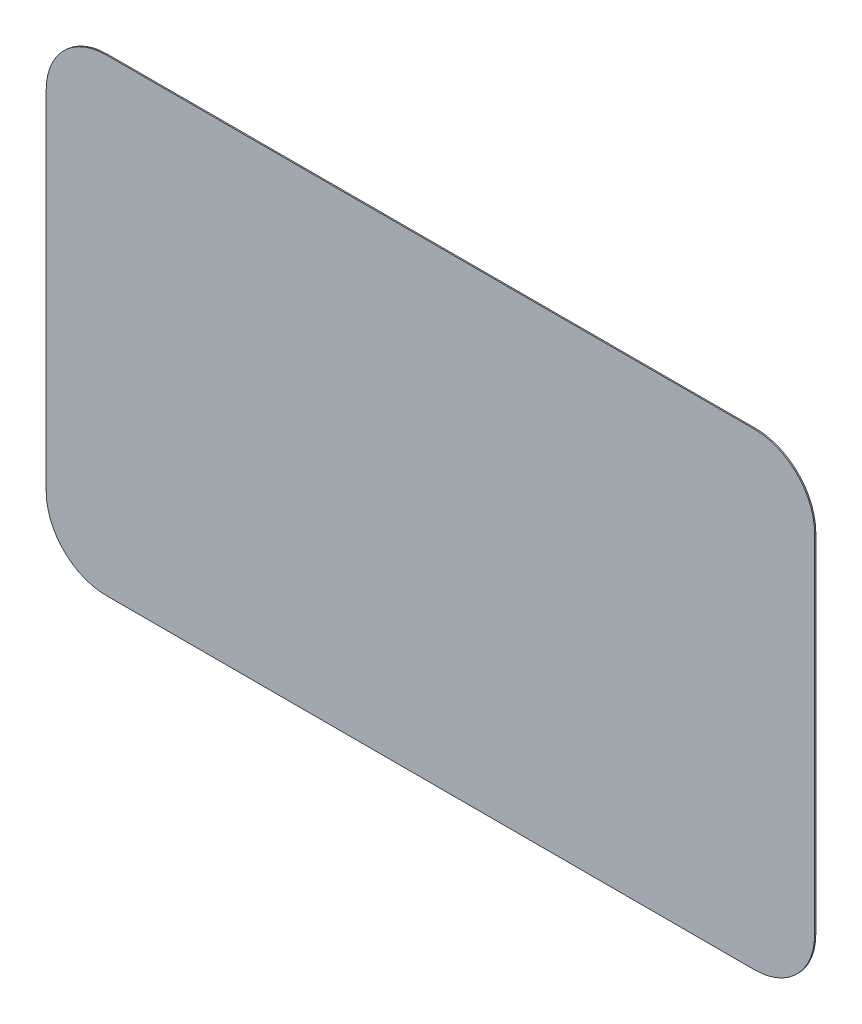
ISO-10303-21;
HEADER;
FILE_DESCRIPTION(('STEP AP214'),'2;1');
FILE_NAME('part.step','',(''),(''),'','','');
FILE_SCHEMA(('AUTOMOTIVE_DESIGN { 1 0 10303 214 1 1 1 1 }'));
ENDSEC;
DATA;
#1=APPLICATION_CONTEXT('core data for automotive mechanical design processes');
#2=APPLICATION_PROTOCOL_DEFINITION('international standard','automotive_design',2000,#1);
#3=PRODUCT_CONTEXT('',#1,'mechanical');
#4=PRODUCT('Part','Part','',(#3));
#5=PRODUCT_RELATED_PRODUCT_CATEGORY('part','',(#4));
#6=PRODUCT_DEFINITION_FORMATION('','',#4);
#7=PRODUCT_DEFINITION_CONTEXT('part definition',#1,'design');
#8=PRODUCT_DEFINITION('design','',#6,#7);
#9=PRODUCT_DEFINITION_SHAPE('','',#8);
#10=(LENGTH_UNIT() NAMED_UNIT(*) SI_UNIT(.MILLI.,.METRE.));
#11=(NAMED_UNIT(*) PLANE_ANGLE_UNIT() SI_UNIT($,.RADIAN.));
#12=(NAMED_UNIT(*) SI_UNIT($,.STERADIAN.) SOLID_ANGLE_UNIT());
#13=UNCERTAINTY_MEASURE_WITH_UNIT(LENGTH_MEASURE(1.E-05),#10,'distance_accuracy_value','');
#14=(GEOMETRIC_REPRESENTATION_CONTEXT(3) GLOBAL_UNCERTAINTY_ASSIGNED_CONTEXT((#13)) GLOBAL_UNIT_ASSIGNED_CONTEXT((#10,
#11,#12)) REPRESENTATION_CONTEXT('',''));
#15=CARTESIAN_POINT('',(0.,0.,0.));
#16=DIRECTION('',(0.,0.,1.));
#17=DIRECTION('',(1.,0.,0.));
#18=AXIS2_PLACEMENT_3D('',#15,#16,#17);
#19=CARTESIAN_POINT('',(-135.,-72.5,0.5));
#20=DIRECTION('',(0.,0.,-1.));
#21=DIRECTION('',(-1.,0.,0.));
#22=AXIS2_PLACEMENT_3D('',#19,#20,#21);
#23=CYLINDRICAL_SURFACE('',#22,25.);
#24=CARTESIAN_POINT('',(-135.,-72.5,0.));
#25=DIRECTION('',(0.,0.,1.));
#26=DIRECTION('',(1.,0.,0.));
#27=AXIS2_PLACEMENT_3D('',#24,#25,#26);
#28=CIRCLE('',#27,25.);
#29=CARTESIAN_POINT('',(-160.,-72.5,0.));
#30=VERTEX_POINT('',#29);
#31=CARTESIAN_POINT('',(-135.,-97.5,0.));
#32=VERTEX_POINT('',#31);
#33=EDGE_CURVE('E257',#30,#32,#28,.T.);
#34=ORIENTED_EDGE('',*,*,#33,.T.);
#35=DIRECTION('',(0.,0.,-1.));
#36=VECTOR('',#35,1.);
#37=CARTESIAN_POINT('',(-135.,-97.5,0.5));
#38=LINE('',#37,#36);
#39=CARTESIAN_POINT('',(-135.,-97.5,0.5));
#40=VERTEX_POINT('',#39);
#41=EDGE_CURVE('E12',#40,#32,#38,.T.);
#42=ORIENTED_EDGE('',*,*,#41,.F.);
#43=CARTESIAN_POINT('',(-135.,-72.5,0.5));
#44=DIRECTION('',(0.,0.,1.));
#45=DIRECTION('',(1.,0.,0.));
#46=AXIS2_PLACEMENT_3D('',#43,#44,#45);
#47=CIRCLE('',#46,25.);
#48=CARTESIAN_POINT('',(-160.,-72.5,0.5));
#49=VERTEX_POINT('',#48);
#50=EDGE_CURVE('E267',#49,#40,#47,.T.);
#51=ORIENTED_EDGE('',*,*,#50,.F.);
#52=DIRECTION('',(0.,0.,-1.));
#53=VECTOR('',#52,1.);
#54=CARTESIAN_POINT('',(-160.,-72.5,0.5));
#55=LINE('',#54,#53);
#56=EDGE_CURVE('E253',#49,#30,#55,.T.);
#57=ORIENTED_EDGE('',*,*,#56,.T.);
#58=EDGE_LOOP('',(#34,#42,#51,#57));
#59=FACE_BOUND('',#58,.T.);
#60=ADVANCED_FACE('F160',(#59),#23,.T.);
#61=CARTESIAN_POINT('',(-135.,-97.5,0.5));
#62=DIRECTION('',(0.,1.,0.));
#63=DIRECTION('',(0.,0.,1.));
#64=AXIS2_PLACEMENT_3D('',#61,#62,#63);
#65=PLANE('',#64);
#66=DIRECTION('',(1.,0.,0.));
#67=VECTOR('',#66,1.);
#68=CARTESIAN_POINT('',(-135.,-97.5,0.));
#69=LINE('',#68,#67);
#70=CARTESIAN_POINT('',(135.,-97.5,0.));
#71=VERTEX_POINT('',#70);
#72=EDGE_CURVE('E260',#32,#71,#69,.T.);
#73=ORIENTED_EDGE('',*,*,#72,.T.);
#74=DIRECTION('',(0.,0.,-1.));
#75=VECTOR('',#74,1.);
#76=CARTESIAN_POINT('',(135.,-97.5,0.5));
#77=LINE('',#76,#75);
#78=CARTESIAN_POINT('',(135.,-97.5,0.5));
#79=VERTEX_POINT('',#78);
#80=EDGE_CURVE('E171',#79,#71,#77,.T.);
#81=ORIENTED_EDGE('',*,*,#80,.F.);
#82=DIRECTION('',(1.,0.,0.));
#83=VECTOR('',#82,1.);
#84=CARTESIAN_POINT('',(-135.,-97.5,0.5));
#85=LINE('',#84,#83);
#86=EDGE_CURVE('E218',#40,#79,#85,.T.);
#87=ORIENTED_EDGE('',*,*,#86,.F.);
#88=ORIENTED_EDGE('',*,*,#41,.T.);
#89=EDGE_LOOP('',(#73,#81,#87,#88));
#90=FACE_BOUND('',#89,.T.);
#91=ADVANCED_FACE('F309',(#90),#65,.F.);
#92=CARTESIAN_POINT('',(135.,-72.5,0.5));
#93=DIRECTION('',(0.,0.,-1.));
#94=DIRECTION('',(-1.,0.,0.));
#95=AXIS2_PLACEMENT_3D('',#92,#93,#94);
#96=CYLINDRICAL_SURFACE('',#95,25.);
#97=CARTESIAN_POINT('',(135.,-72.5,0.));
#98=DIRECTION('',(0.,0.,1.));
#99=DIRECTION('',(0.,-1.,0.));
#100=AXIS2_PLACEMENT_3D('',#97,#98,#99);
#101=CIRCLE('',#100,25.);
#102=CARTESIAN_POINT('',(160.,-72.5,0.));
#103=VERTEX_POINT('',#102);
#104=EDGE_CURVE('E277',#71,#103,#101,.T.);
#105=ORIENTED_EDGE('',*,*,#104,.T.);
#106=DIRECTION('',(0.,0.,-1.));
#107=VECTOR('',#106,1.);
#108=CARTESIAN_POINT('',(160.,-72.5,0.5));
#109=LINE('',#108,#107);
#110=CARTESIAN_POINT('',(160.,-72.5,0.5));
#111=VERTEX_POINT('',#110);
#112=EDGE_CURVE('E273',#111,#103,#109,.T.);
#113=ORIENTED_EDGE('',*,*,#112,.F.);
#114=CARTESIAN_POINT('',(135.,-72.5,0.5));
#115=DIRECTION('',(0.,0.,1.));
#116=DIRECTION('',(1.,0.,0.));
#117=AXIS2_PLACEMENT_3D('',#114,#115,#116);
#118=CIRCLE('',#117,25.);
#119=EDGE_CURVE('E323',#79,#111,#118,.T.);
#120=ORIENTED_EDGE('',*,*,#119,.F.);
#121=ORIENTED_EDGE('',*,*,#80,.T.);
#122=EDGE_LOOP('',(#105,#113,#120,#121));
#123=FACE_BOUND('',#122,.T.);
#124=ADVANCED_FACE('F299',(#123),#96,.T.);
#125=CARTESIAN_POINT('',(160.,-72.5,0.5));
#126=DIRECTION('',(-1.,0.,0.));
#127=DIRECTION('',(0.,0.,1.));
#128=AXIS2_PLACEMENT_3D('',#125,#126,#127);
#129=PLANE('',#128);
#130=DIRECTION('',(0.,1.,0.));
#131=VECTOR('',#130,1.);
#132=CARTESIAN_POINT('',(160.,-72.5,0.));
#133=LINE('',#132,#131);
#134=CARTESIAN_POINT('',(160.,72.5,0.));
#135=VERTEX_POINT('',#134);
#136=EDGE_CURVE('E263',#103,#135,#133,.T.);
#137=ORIENTED_EDGE('',*,*,#136,.T.);
#138=DIRECTION('',(0.,0.,-1.));
#139=VECTOR('',#138,1.);
#140=CARTESIAN_POINT('',(160.,72.5,0.5));
#141=LINE('',#140,#139);
#142=CARTESIAN_POINT('',(160.,72.5,0.5));
#143=VERTEX_POINT('',#142);
#144=EDGE_CURVE('E271',#143,#135,#141,.T.);
#145=ORIENTED_EDGE('',*,*,#144,.F.);
#146=DIRECTION('',(0.,1.,0.));
#147=VECTOR('',#146,1.);
#148=CARTESIAN_POINT('',(160.,-72.5,0.5));
#149=LINE('',#148,#147);
#150=EDGE_CURVE('E325',#111,#143,#149,.T.);
#151=ORIENTED_EDGE('',*,*,#150,.F.);
#152=ORIENTED_EDGE('',*,*,#112,.T.);
#153=EDGE_LOOP('',(#137,#145,#151,#152));
#154=FACE_BOUND('',#153,.T.);
#155=ADVANCED_FACE('F308',(#154),#129,.F.);
#156=CARTESIAN_POINT('',(135.,72.5,0.5));
#157=DIRECTION('',(0.,0.,-1.));
#158=DIRECTION('',(-1.,0.,0.));
#159=AXIS2_PLACEMENT_3D('',#156,#157,#158);
#160=CYLINDRICAL_SURFACE('',#159,25.);
#161=CARTESIAN_POINT('',(135.,72.5,0.));
#162=DIRECTION('',(0.,0.,1.));
#163=DIRECTION('',(1.,0.,0.));
#164=AXIS2_PLACEMENT_3D('',#161,#162,#163);
#165=CIRCLE('',#164,25.);
#166=CARTESIAN_POINT('',(135.,97.5,0.));
#167=VERTEX_POINT('',#166);
#168=EDGE_CURVE('E261',#135,#167,#165,.T.);
#169=ORIENTED_EDGE('',*,*,#168,.T.);
#170=DIRECTION('',(0.,0.,-1.));
#171=VECTOR('',#170,1.);
#172=CARTESIAN_POINT('',(135.,97.5,0.5));
#173=LINE('',#172,#171);
#174=CARTESIAN_POINT('',(135.,97.5,0.5));
#175=VERTEX_POINT('',#174);
#176=EDGE_CURVE('E248',#175,#167,#173,.T.);
#177=ORIENTED_EDGE('',*,*,#176,.F.);
#178=CARTESIAN_POINT('',(135.,72.5,0.5));
#179=DIRECTION('',(0.,0.,1.));
#180=DIRECTION('',(1.,0.,0.));
#181=AXIS2_PLACEMENT_3D('',#178,#179,#180);
#182=CIRCLE('',#181,25.);
#183=EDGE_CURVE('E239',#143,#175,#182,.T.);
#184=ORIENTED_EDGE('',*,*,#183,.F.);
#185=ORIENTED_EDGE('',*,*,#144,.T.);
#186=EDGE_LOOP('',(#169,#177,#184,#185));
#187=FACE_BOUND('',#186,.T.);
#188=ADVANCED_FACE('F332',(#187),#160,.T.);
#189=CARTESIAN_POINT('',(135.,97.5,0.5));
#190=DIRECTION('',(0.,-1.,0.));
#191=DIRECTION('',(0.,0.,-1.));
#192=AXIS2_PLACEMENT_3D('',#189,#190,#191);
#193=PLANE('',#192);
#194=DIRECTION('',(-1.,0.,0.));
#195=VECTOR('',#194,1.);
#196=CARTESIAN_POINT('',(135.,97.5,0.));
#197=LINE('',#196,#195);
#198=CARTESIAN_POINT('',(-135.,97.5,0.));
#199=VERTEX_POINT('',#198);
#200=EDGE_CURVE('E247',#167,#199,#197,.T.);
#201=ORIENTED_EDGE('',*,*,#200,.T.);
#202=DIRECTION('',(0.,0.,-1.));
#203=VECTOR('',#202,1.);
#204=CARTESIAN_POINT('',(-135.,97.5,0.5));
#205=LINE('',#204,#203);
#206=CARTESIAN_POINT('',(-135.,97.5,0.5));
#207=VERTEX_POINT('',#206);
#208=EDGE_CURVE('E244',#207,#199,#205,.T.);
#209=ORIENTED_EDGE('',*,*,#208,.F.);
#210=DIRECTION('',(-1.,0.,0.));
#211=VECTOR('',#210,1.);
#212=CARTESIAN_POINT('',(135.,97.5,0.5));
#213=LINE('',#212,#211);
#214=EDGE_CURVE('E233',#175,#207,#213,.T.);
#215=ORIENTED_EDGE('',*,*,#214,.F.);
#216=ORIENTED_EDGE('',*,*,#176,.T.);
#217=EDGE_LOOP('',(#201,#209,#215,#216));
#218=FACE_BOUND('',#217,.T.);
#219=ADVANCED_FACE('F245',(#218),#193,.F.);
#220=CARTESIAN_POINT('',(-135.,72.5,0.5));
#221=DIRECTION('',(0.,0.,-1.));
#222=DIRECTION('',(-1.,0.,0.));
#223=AXIS2_PLACEMENT_3D('',#220,#221,#222);
#224=CYLINDRICAL_SURFACE('',#223,25.);
#225=CARTESIAN_POINT('',(-135.,72.5,0.));
#226=DIRECTION('',(0.,0.,1.));
#227=DIRECTION('',(1.,0.,0.));
#228=AXIS2_PLACEMENT_3D('',#225,#226,#227);
#229=CIRCLE('',#228,25.);
#230=CARTESIAN_POINT('',(-160.,72.5,0.));
#231=VERTEX_POINT('',#230);
#232=EDGE_CURVE('E204',#199,#231,#229,.T.);
#233=ORIENTED_EDGE('',*,*,#232,.T.);
#234=DIRECTION('',(0.,0.,-1.));
#235=VECTOR('',#234,1.);
#236=CARTESIAN_POINT('',(-160.,72.5,0.5));
#237=LINE('',#236,#235);
#238=CARTESIAN_POINT('',(-160.,72.5,0.5));
#239=VERTEX_POINT('',#238);
#240=EDGE_CURVE('E249',#239,#231,#237,.T.);
#241=ORIENTED_EDGE('',*,*,#240,.F.);
#242=CARTESIAN_POINT('',(-135.,72.5,0.5));
#243=DIRECTION('',(0.,0.,1.));
#244=DIRECTION('',(1.,0.,0.));
#245=AXIS2_PLACEMENT_3D('',#242,#243,#244);
#246=CIRCLE('',#245,25.);
#247=EDGE_CURVE('E237',#207,#239,#246,.T.);
#248=ORIENTED_EDGE('',*,*,#247,.F.);
#249=ORIENTED_EDGE('',*,*,#208,.T.);
#250=EDGE_LOOP('',(#233,#241,#248,#249));
#251=FACE_BOUND('',#250,.T.);
#252=ADVANCED_FACE('F251',(#251),#224,.T.);
#253=CARTESIAN_POINT('',(-160.,72.5,0.5));
#254=DIRECTION('',(1.,0.,0.));
#255=DIRECTION('',(0.,0.,-1.));
#256=AXIS2_PLACEMENT_3D('',#253,#254,#255);
#257=PLANE('',#256);
#258=DIRECTION('',(0.,-1.,0.));
#259=VECTOR('',#258,1.);
#260=CARTESIAN_POINT('',(-160.,72.5,0.));
#261=LINE('',#260,#259);
#262=EDGE_CURVE('E210',#231,#30,#261,.T.);
#263=ORIENTED_EDGE('',*,*,#262,.T.);
#264=ORIENTED_EDGE('',*,*,#56,.F.);
#265=DIRECTION('',(0.,-1.,0.));
#266=VECTOR('',#265,1.);
#267=CARTESIAN_POINT('',(-160.,72.5,0.5));
#268=LINE('',#267,#266);
#269=EDGE_CURVE('E180',#239,#49,#268,.T.);
#270=ORIENTED_EDGE('',*,*,#269,.F.);
#271=ORIENTED_EDGE('',*,*,#240,.T.);
#272=EDGE_LOOP('',(#263,#264,#270,#271));
#273=FACE_BOUND('',#272,.T.);
#274=ADVANCED_FACE('F346',(#273),#257,.F.);
#275=CARTESIAN_POINT('',(-135.,-72.5,0.5));
#276=DIRECTION('',(0.,0.,1.));
#277=DIRECTION('',(1.,0.,0.));
#278=AXIS2_PLACEMENT_3D('',#275,#276,#277);
#279=PLANE('',#278);
#280=ORIENTED_EDGE('',*,*,#50,.T.);
#281=ORIENTED_EDGE('',*,*,#86,.T.);
#282=ORIENTED_EDGE('',*,*,#119,.T.);
#283=ORIENTED_EDGE('',*,*,#150,.T.);
#284=ORIENTED_EDGE('',*,*,#183,.T.);
#285=ORIENTED_EDGE('',*,*,#214,.T.);
#286=ORIENTED_EDGE('',*,*,#247,.T.);
#287=ORIENTED_EDGE('',*,*,#269,.T.);
#288=EDGE_LOOP('',(#280,#281,#282,#283,#284,#285,#286,#287));
#289=FACE_BOUND('',#288,.T.);
#290=ADVANCED_FACE('F235',(#289),#279,.T.);
#291=CARTESIAN_POINT('',(-135.,-72.5,0.));
#292=DIRECTION('',(0.,0.,1.));
#293=DIRECTION('',(1.,0.,0.));
#294=AXIS2_PLACEMENT_3D('',#291,#292,#293);
#295=PLANE('',#294);
#296=ORIENTED_EDGE('',*,*,#104,.F.);
#297=ORIENTED_EDGE('',*,*,#72,.F.);
#298=ORIENTED_EDGE('',*,*,#33,.F.);
#299=ORIENTED_EDGE('',*,*,#262,.F.);
#300=ORIENTED_EDGE('',*,*,#232,.F.);
#301=ORIENTED_EDGE('',*,*,#200,.F.);
#302=ORIENTED_EDGE('',*,*,#168,.F.);
#303=ORIENTED_EDGE('',*,*,#136,.F.);
#304=EDGE_LOOP('',(#296,#297,#298,#299,#300,#301,#302,#303));
#305=FACE_BOUND('',#304,.T.);
#306=ADVANCED_FACE('F321',(#305),#295,.F.);
#307=CLOSED_SHELL('',(#60,#91,#124,#155,#188,#219,#252,#274,#290,#306));
#308=MANIFOLD_SOLID_BREP('B2',#307);
#309=ADVANCED_BREP_SHAPE_REPRESENTATION('',(#18,#308),#14);
#310=SHAPE_DEFINITION_REPRESENTATION(#9,#309);
ENDSEC;
END-ISO-10303-21;
